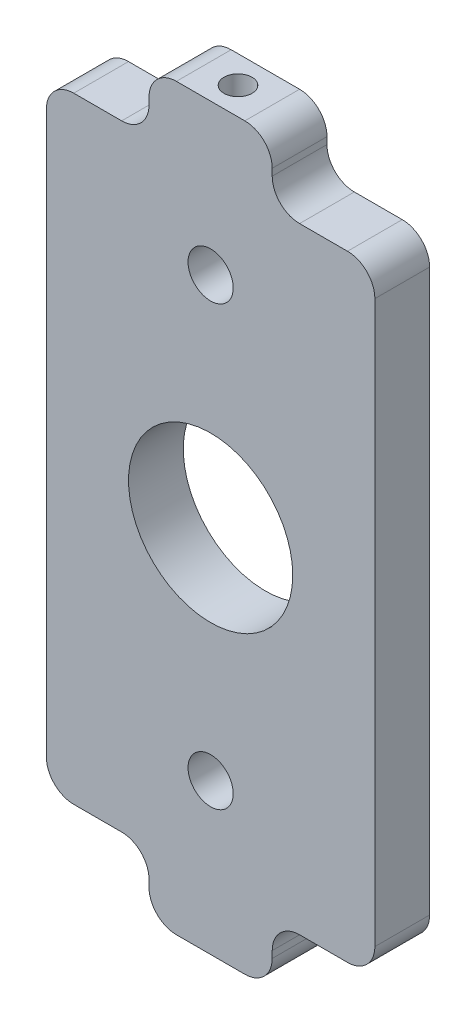
ISO-10303-21;
HEADER;
FILE_DESCRIPTION(('STEP AP214'),'2;1');
FILE_NAME('part.step','',(''),(''),'','','');
FILE_SCHEMA(('AUTOMOTIVE_DESIGN { 1 0 10303 214 1 1 1 1 }'));
ENDSEC;
DATA;
#1=APPLICATION_CONTEXT('core data for automotive mechanical design processes');
#2=APPLICATION_PROTOCOL_DEFINITION('international standard','automotive_design',2000,#1);
#3=PRODUCT_CONTEXT('',#1,'mechanical');
#4=PRODUCT('Part','Part','',(#3));
#5=PRODUCT_RELATED_PRODUCT_CATEGORY('part','',(#4));
#6=PRODUCT_DEFINITION_FORMATION('','',#4);
#7=PRODUCT_DEFINITION_CONTEXT('part definition',#1,'design');
#8=PRODUCT_DEFINITION('design','',#6,#7);
#9=PRODUCT_DEFINITION_SHAPE('','',#8);
#10=(LENGTH_UNIT() NAMED_UNIT(*) SI_UNIT(.MILLI.,.METRE.));
#11=(NAMED_UNIT(*) PLANE_ANGLE_UNIT() SI_UNIT($,.RADIAN.));
#12=(NAMED_UNIT(*) SI_UNIT($,.STERADIAN.) SOLID_ANGLE_UNIT());
#13=UNCERTAINTY_MEASURE_WITH_UNIT(LENGTH_MEASURE(1.E-05),#10,'distance_accuracy_value','');
#14=(GEOMETRIC_REPRESENTATION_CONTEXT(3) GLOBAL_UNCERTAINTY_ASSIGNED_CONTEXT((#13)) GLOBAL_UNIT_ASSIGNED_CONTEXT((#10,
#11,#12)) REPRESENTATION_CONTEXT('',''));
#15=CARTESIAN_POINT('',(0.,0.,0.));
#16=DIRECTION('',(0.,0.,1.));
#17=DIRECTION('',(1.,0.,0.));
#18=AXIS2_PLACEMENT_3D('',#15,#16,#17);
#19=CARTESIAN_POINT('',(-2.49999999999999,-25.,0.));
#20=DIRECTION('',(0.,0.,1.));
#21=DIRECTION('',(1.,0.,0.));
#22=AXIS2_PLACEMENT_3D('',#19,#20,#21);
#23=PLANE('',#22);
#24=CARTESIAN_POINT('',(0.,16.,0.));
#25=DIRECTION('',(0.,0.,-1.));
#26=DIRECTION('',(-1.,0.,0.));
#27=AXIS2_PLACEMENT_3D('',#24,#25,#26);
#28=CIRCLE('',#27,1.64999999999999);
#29=CARTESIAN_POINT('',(-1.64999999999999,16.,0.));
#30=VERTEX_POINT('',#29);
#31=EDGE_CURVE('E803',#30,#30,#28,.T.);
#32=ORIENTED_EDGE('',*,*,#31,.F.);
#33=EDGE_LOOP('',(#32));
#34=FACE_BOUND('',#33,.T.);
#35=CARTESIAN_POINT('',(-2.49999999999999,-25.,0.));
#36=DIRECTION('',(0.,0.,1.));
#37=DIRECTION('',(1.,0.,0.));
#38=AXIS2_PLACEMENT_3D('',#35,#36,#37);
#39=CIRCLE('',#38,2.);
#40=CARTESIAN_POINT('',(-4.49999999999999,-25.,0.));
#41=VERTEX_POINT('',#40);
#42=CARTESIAN_POINT('',(-2.49999999999999,-27.,0.));
#43=VERTEX_POINT('',#42);
#44=EDGE_CURVE('E230',#41,#43,#39,.T.);
#45=ORIENTED_EDGE('',*,*,#44,.F.);
#46=DIRECTION('',(0.,-1.,0.));
#47=VECTOR('',#46,1.);
#48=CARTESIAN_POINT('',(-4.49999999999999,-24.5,0.));
#49=LINE('',#48,#47);
#50=CARTESIAN_POINT('',(-4.49999999999999,-24.5,0.));
#51=VERTEX_POINT('',#50);
#52=EDGE_CURVE('E237',#51,#41,#49,.T.);
#53=ORIENTED_EDGE('',*,*,#52,.F.);
#54=CARTESIAN_POINT('',(-6.49999999999999,-24.5,0.));
#55=DIRECTION('',(0.,0.,-1.));
#56=DIRECTION('',(1.,0.,0.));
#57=AXIS2_PLACEMENT_3D('',#54,#55,#56);
#58=CIRCLE('',#57,2.);
#59=CARTESIAN_POINT('',(-6.49999999999999,-22.5,0.));
#60=VERTEX_POINT('',#59);
#61=EDGE_CURVE('E322',#60,#51,#58,.T.);
#62=ORIENTED_EDGE('',*,*,#61,.F.);
#63=DIRECTION('',(1.,0.,0.));
#64=VECTOR('',#63,1.);
#65=CARTESIAN_POINT('',(-10.,-22.5,0.));
#66=LINE('',#65,#64);
#67=CARTESIAN_POINT('',(-10.,-22.5,0.));
#68=VERTEX_POINT('',#67);
#69=EDGE_CURVE('E320',#68,#60,#66,.T.);
#70=ORIENTED_EDGE('',*,*,#69,.F.);
#71=CARTESIAN_POINT('',(-10.,-20.5,0.));
#72=DIRECTION('',(0.,0.,1.));
#73=DIRECTION('',(1.,0.,0.));
#74=AXIS2_PLACEMENT_3D('',#71,#72,#73);
#75=CIRCLE('',#74,2.);
#76=CARTESIAN_POINT('',(-12.,-20.5,0.));
#77=VERTEX_POINT('',#76);
#78=EDGE_CURVE('E318',#77,#68,#75,.T.);
#79=ORIENTED_EDGE('',*,*,#78,.F.);
#80=DIRECTION('',(0.,-1.,0.));
#81=VECTOR('',#80,1.);
#82=CARTESIAN_POINT('',(-12.,20.5,0.));
#83=LINE('',#82,#81);
#84=CARTESIAN_POINT('',(-12.,20.5,0.));
#85=VERTEX_POINT('',#84);
#86=EDGE_CURVE('E316',#85,#77,#83,.T.);
#87=ORIENTED_EDGE('',*,*,#86,.F.);
#88=CARTESIAN_POINT('',(-9.99999999999999,20.5,0.));
#89=DIRECTION('',(0.,0.,1.));
#90=DIRECTION('',(1.,0.,0.));
#91=AXIS2_PLACEMENT_3D('',#88,#89,#90);
#92=CIRCLE('',#91,2.);
#93=CARTESIAN_POINT('',(-9.99999999999999,22.5,0.));
#94=VERTEX_POINT('',#93);
#95=EDGE_CURVE('E314',#94,#85,#92,.T.);
#96=ORIENTED_EDGE('',*,*,#95,.F.);
#97=DIRECTION('',(-1.,0.,0.));
#98=VECTOR('',#97,1.);
#99=CARTESIAN_POINT('',(-4.49999999999999,22.5,0.));
#100=LINE('',#99,#98);
#101=CARTESIAN_POINT('',(-6.49999999999999,22.5,0.));
#102=VERTEX_POINT('',#101);
#103=EDGE_CURVE('E312',#102,#94,#100,.T.);
#104=ORIENTED_EDGE('',*,*,#103,.F.);
#105=CARTESIAN_POINT('',(-6.49999999999999,24.5,0.));
#106=DIRECTION('',(0.,0.,1.));
#107=DIRECTION('',(1.,0.,0.));
#108=AXIS2_PLACEMENT_3D('',#105,#106,#107);
#109=CIRCLE('',#108,2.);
#110=CARTESIAN_POINT('',(-4.49999999999999,24.5,0.));
#111=VERTEX_POINT('',#110);
#112=EDGE_CURVE('E46',#102,#111,#109,.T.);
#113=ORIENTED_EDGE('',*,*,#112,.T.);
#114=DIRECTION('',(0.,-1.,0.));
#115=VECTOR('',#114,1.);
#116=CARTESIAN_POINT('',(-4.49999999999999,25.,0.));
#117=LINE('',#116,#115);
#118=CARTESIAN_POINT('',(-4.49999999999999,25.,0.));
#119=VERTEX_POINT('',#118);
#120=EDGE_CURVE('E310',#119,#111,#117,.T.);
#121=ORIENTED_EDGE('',*,*,#120,.F.);
#122=CARTESIAN_POINT('',(-2.49999999999999,25.,0.));
#123=DIRECTION('',(0.,0.,1.));
#124=DIRECTION('',(1.,0.,0.));
#125=AXIS2_PLACEMENT_3D('',#122,#123,#124);
#126=CIRCLE('',#125,2.);
#127=CARTESIAN_POINT('',(-2.49999999999999,27.,0.));
#128=VERTEX_POINT('',#127);
#129=EDGE_CURVE('E308',#128,#119,#126,.T.);
#130=ORIENTED_EDGE('',*,*,#129,.F.);
#131=DIRECTION('',(-1.,0.,0.));
#132=VECTOR('',#131,1.);
#133=CARTESIAN_POINT('',(2.50000000000001,27.,0.));
#134=LINE('',#133,#132);
#135=CARTESIAN_POINT('',(2.50000000000001,27.,0.));
#136=VERTEX_POINT('',#135);
#137=EDGE_CURVE('E306',#136,#128,#134,.T.);
#138=ORIENTED_EDGE('',*,*,#137,.F.);
#139=CARTESIAN_POINT('',(2.50000000000001,25.,0.));
#140=DIRECTION('',(0.,0.,1.));
#141=DIRECTION('',(1.,0.,0.));
#142=AXIS2_PLACEMENT_3D('',#139,#140,#141);
#143=CIRCLE('',#142,2.);
#144=CARTESIAN_POINT('',(4.50000000000001,25.,0.));
#145=VERTEX_POINT('',#144);
#146=EDGE_CURVE('E304',#145,#136,#143,.T.);
#147=ORIENTED_EDGE('',*,*,#146,.F.);
#148=DIRECTION('',(0.,1.,0.));
#149=VECTOR('',#148,1.);
#150=CARTESIAN_POINT('',(4.50000000000001,22.5,0.));
#151=LINE('',#150,#149);
#152=CARTESIAN_POINT('',(4.50000000000001,24.5,0.));
#153=VERTEX_POINT('',#152);
#154=EDGE_CURVE('E302',#153,#145,#151,.T.);
#155=ORIENTED_EDGE('',*,*,#154,.F.);
#156=CARTESIAN_POINT('',(6.50000000000001,24.5,0.));
#157=DIRECTION('',(0.,0.,1.));
#158=DIRECTION('',(1.,0.,0.));
#159=AXIS2_PLACEMENT_3D('',#156,#157,#158);
#160=CIRCLE('',#159,2.);
#161=CARTESIAN_POINT('',(6.50000000000001,22.5,0.));
#162=VERTEX_POINT('',#161);
#163=EDGE_CURVE('E393',#153,#162,#160,.T.);
#164=ORIENTED_EDGE('',*,*,#163,.T.);
#165=DIRECTION('',(-1.,0.,0.));
#166=VECTOR('',#165,1.);
#167=CARTESIAN_POINT('',(10.,22.5,0.));
#168=LINE('',#167,#166);
#169=CARTESIAN_POINT('',(10.,22.5,0.));
#170=VERTEX_POINT('',#169);
#171=EDGE_CURVE('E299',#170,#162,#168,.T.);
#172=ORIENTED_EDGE('',*,*,#171,.F.);
#173=CARTESIAN_POINT('',(10.,20.5,0.));
#174=DIRECTION('',(0.,0.,1.));
#175=DIRECTION('',(1.,0.,0.));
#176=AXIS2_PLACEMENT_3D('',#173,#174,#175);
#177=CIRCLE('',#176,2.);
#178=CARTESIAN_POINT('',(12.,20.5,0.));
#179=VERTEX_POINT('',#178);
#180=EDGE_CURVE('E297',#179,#170,#177,.T.);
#181=ORIENTED_EDGE('',*,*,#180,.F.);
#182=DIRECTION('',(0.,1.,0.));
#183=VECTOR('',#182,1.);
#184=CARTESIAN_POINT('',(12.,-20.5,0.));
#185=LINE('',#184,#183);
#186=CARTESIAN_POINT('',(12.,-20.5,0.));
#187=VERTEX_POINT('',#186);
#188=EDGE_CURVE('E295',#187,#179,#185,.T.);
#189=ORIENTED_EDGE('',*,*,#188,.F.);
#190=CARTESIAN_POINT('',(10.,-20.5,0.));
#191=DIRECTION('',(0.,0.,1.));
#192=DIRECTION('',(1.,0.,0.));
#193=AXIS2_PLACEMENT_3D('',#190,#191,#192);
#194=CIRCLE('',#193,2.);
#195=CARTESIAN_POINT('',(10.,-22.5,0.));
#196=VERTEX_POINT('',#195);
#197=EDGE_CURVE('E293',#196,#187,#194,.T.);
#198=ORIENTED_EDGE('',*,*,#197,.F.);
#199=DIRECTION('',(1.,0.,0.));
#200=VECTOR('',#199,1.);
#201=CARTESIAN_POINT('',(6.50000000000001,-22.5,0.));
#202=LINE('',#201,#200);
#203=CARTESIAN_POINT('',(6.50000000000001,-22.5,0.));
#204=VERTEX_POINT('',#203);
#205=EDGE_CURVE('E291',#204,#196,#202,.T.);
#206=ORIENTED_EDGE('',*,*,#205,.F.);
#207=CARTESIAN_POINT('',(6.50000000000001,-24.5,0.));
#208=DIRECTION('',(0.,0.,-1.));
#209=DIRECTION('',(1.,0.,0.));
#210=AXIS2_PLACEMENT_3D('',#207,#208,#209);
#211=CIRCLE('',#210,2.);
#212=CARTESIAN_POINT('',(4.50000000000001,-24.5,0.));
#213=VERTEX_POINT('',#212);
#214=EDGE_CURVE('E289',#213,#204,#211,.T.);
#215=ORIENTED_EDGE('',*,*,#214,.F.);
#216=DIRECTION('',(0.,1.,0.));
#217=VECTOR('',#216,1.);
#218=CARTESIAN_POINT('',(4.50000000000001,-25.,0.));
#219=LINE('',#218,#217);
#220=CARTESIAN_POINT('',(4.50000000000001,-25.,0.));
#221=VERTEX_POINT('',#220);
#222=EDGE_CURVE('E287',#221,#213,#219,.T.);
#223=ORIENTED_EDGE('',*,*,#222,.F.);
#224=CARTESIAN_POINT('',(2.50000000000001,-25.,0.));
#225=DIRECTION('',(0.,0.,1.));
#226=DIRECTION('',(1.,0.,0.));
#227=AXIS2_PLACEMENT_3D('',#224,#225,#226);
#228=CIRCLE('',#227,2.);
#229=CARTESIAN_POINT('',(2.50000000000002,-27.,0.));
#230=VERTEX_POINT('',#229);
#231=EDGE_CURVE('E285',#230,#221,#228,.T.);
#232=ORIENTED_EDGE('',*,*,#231,.F.);
#233=DIRECTION('',(1.,0.,0.));
#234=VECTOR('',#233,1.);
#235=CARTESIAN_POINT('',(-2.49999999999999,-27.,0.));
#236=LINE('',#235,#234);
#237=EDGE_CURVE('E283',#43,#230,#236,.T.);
#238=ORIENTED_EDGE('',*,*,#237,.F.);
#239=EDGE_LOOP('',(#45,#53,#62,#70,#79,#87,#96,#104,#113,#121,#130,#138,#147,#155,#164,#172,
#181,#189,#198,#206,#215,#223,#232,#238));
#240=FACE_BOUND('',#239,.T.);
#241=CARTESIAN_POINT('',(0.,0.,0.));
#242=DIRECTION('',(0.,0.,1.));
#243=DIRECTION('',(1.,0.,0.));
#244=AXIS2_PLACEMENT_3D('',#241,#242,#243);
#245=CIRCLE('',#244,6.00000000000002);
#246=CARTESIAN_POINT('',(6.00000000000002,0.,0.));
#247=VERTEX_POINT('',#246);
#248=EDGE_CURVE('E226',#247,#247,#245,.T.);
#249=ORIENTED_EDGE('',*,*,#248,.T.);
#250=EDGE_LOOP('',(#249));
#251=FACE_BOUND('',#250,.T.);
#252=CARTESIAN_POINT('',(0.,-16.,0.));
#253=DIRECTION('',(0.,0.,-1.));
#254=DIRECTION('',(-1.,0.,0.));
#255=AXIS2_PLACEMENT_3D('',#252,#253,#254);
#256=CIRCLE('',#255,1.64999999999999);
#257=CARTESIAN_POINT('',(-1.64999999999999,-16.,0.));
#258=VERTEX_POINT('',#257);
#259=EDGE_CURVE('E805',#258,#258,#256,.T.);
#260=ORIENTED_EDGE('',*,*,#259,.F.);
#261=EDGE_LOOP('',(#260));
#262=FACE_BOUND('',#261,.T.);
#263=ADVANCED_FACE('F38',(#34,#240,#251,#262),#23,.F.);
#264=CARTESIAN_POINT('',(-2.49999999999999,-25.,4.));
#265=DIRECTION('',(0.,0.,1.));
#266=DIRECTION('',(1.,0.,0.));
#267=AXIS2_PLACEMENT_3D('',#264,#265,#266);
#268=PLANE('',#267);
#269=CARTESIAN_POINT('',(0.,16.,4.));
#270=DIRECTION('',(0.,0.,1.));
#271=DIRECTION('',(1.,0.,0.));
#272=AXIS2_PLACEMENT_3D('',#269,#270,#271);
#273=CIRCLE('',#272,1.64999999999999);
#274=CARTESIAN_POINT('',(1.64999999999999,16.,4.));
#275=VERTEX_POINT('',#274);
#276=EDGE_CURVE('E801',#275,#275,#273,.T.);
#277=ORIENTED_EDGE('',*,*,#276,.F.);
#278=EDGE_LOOP('',(#277));
#279=FACE_BOUND('',#278,.T.);
#280=CARTESIAN_POINT('',(0.,-16.,4.));
#281=DIRECTION('',(0.,0.,1.));
#282=DIRECTION('',(1.,0.,0.));
#283=AXIS2_PLACEMENT_3D('',#280,#281,#282);
#284=CIRCLE('',#283,1.64999999999999);
#285=CARTESIAN_POINT('',(1.64999999999999,-16.,4.));
#286=VERTEX_POINT('',#285);
#287=EDGE_CURVE('E220',#286,#286,#284,.T.);
#288=ORIENTED_EDGE('',*,*,#287,.F.);
#289=EDGE_LOOP('',(#288));
#290=FACE_BOUND('',#289,.T.);
#291=CARTESIAN_POINT('',(-2.49999999999999,-25.,4.));
#292=DIRECTION('',(0.,0.,1.));
#293=DIRECTION('',(1.,0.,0.));
#294=AXIS2_PLACEMENT_3D('',#291,#292,#293);
#295=CIRCLE('',#294,2.);
#296=CARTESIAN_POINT('',(-4.49999999999999,-25.,4.));
#297=VERTEX_POINT('',#296);
#298=CARTESIAN_POINT('',(-2.49999999999999,-27.,4.));
#299=VERTEX_POINT('',#298);
#300=EDGE_CURVE('E233',#297,#299,#295,.T.);
#301=ORIENTED_EDGE('',*,*,#300,.T.);
#302=DIRECTION('',(1.,0.,0.));
#303=VECTOR('',#302,1.);
#304=CARTESIAN_POINT('',(-2.49999999999999,-27.,4.));
#305=LINE('',#304,#303);
#306=CARTESIAN_POINT('',(2.50000000000002,-27.,4.));
#307=VERTEX_POINT('',#306);
#308=EDGE_CURVE('E236',#299,#307,#305,.T.);
#309=ORIENTED_EDGE('',*,*,#308,.T.);
#310=CARTESIAN_POINT('',(2.50000000000001,-25.,4.));
#311=DIRECTION('',(0.,0.,1.));
#312=DIRECTION('',(1.,0.,0.));
#313=AXIS2_PLACEMENT_3D('',#310,#311,#312);
#314=CIRCLE('',#313,2.);
#315=CARTESIAN_POINT('',(4.50000000000001,-25.,4.));
#316=VERTEX_POINT('',#315);
#317=EDGE_CURVE('E239',#307,#316,#314,.T.);
#318=ORIENTED_EDGE('',*,*,#317,.T.);
#319=DIRECTION('',(0.,1.,0.));
#320=VECTOR('',#319,1.);
#321=CARTESIAN_POINT('',(4.50000000000001,-25.,4.));
#322=LINE('',#321,#320);
#323=CARTESIAN_POINT('',(4.50000000000001,-24.5,4.));
#324=VERTEX_POINT('',#323);
#325=EDGE_CURVE('E241',#316,#324,#322,.T.);
#326=ORIENTED_EDGE('',*,*,#325,.T.);
#327=CARTESIAN_POINT('',(6.50000000000001,-24.5,4.));
#328=DIRECTION('',(0.,0.,-1.));
#329=DIRECTION('',(1.,0.,0.));
#330=AXIS2_PLACEMENT_3D('',#327,#328,#329);
#331=CIRCLE('',#330,2.);
#332=CARTESIAN_POINT('',(6.50000000000001,-22.5,4.));
#333=VERTEX_POINT('',#332);
#334=EDGE_CURVE('E243',#324,#333,#331,.T.);
#335=ORIENTED_EDGE('',*,*,#334,.T.);
#336=DIRECTION('',(1.,0.,0.));
#337=VECTOR('',#336,1.);
#338=CARTESIAN_POINT('',(6.50000000000001,-22.5,4.));
#339=LINE('',#338,#337);
#340=CARTESIAN_POINT('',(10.,-22.5,4.));
#341=VERTEX_POINT('',#340);
#342=EDGE_CURVE('E245',#333,#341,#339,.T.);
#343=ORIENTED_EDGE('',*,*,#342,.T.);
#344=CARTESIAN_POINT('',(10.,-20.5,4.));
#345=DIRECTION('',(0.,0.,1.));
#346=DIRECTION('',(1.,0.,0.));
#347=AXIS2_PLACEMENT_3D('',#344,#345,#346);
#348=CIRCLE('',#347,2.);
#349=CARTESIAN_POINT('',(12.,-20.5,4.));
#350=VERTEX_POINT('',#349);
#351=EDGE_CURVE('E247',#341,#350,#348,.T.);
#352=ORIENTED_EDGE('',*,*,#351,.T.);
#353=DIRECTION('',(0.,1.,0.));
#354=VECTOR('',#353,1.);
#355=CARTESIAN_POINT('',(12.,-20.5,4.));
#356=LINE('',#355,#354);
#357=CARTESIAN_POINT('',(12.,20.5,4.));
#358=VERTEX_POINT('',#357);
#359=EDGE_CURVE('E249',#350,#358,#356,.T.);
#360=ORIENTED_EDGE('',*,*,#359,.T.);
#361=CARTESIAN_POINT('',(10.,20.5,4.));
#362=DIRECTION('',(0.,0.,1.));
#363=DIRECTION('',(1.,0.,0.));
#364=AXIS2_PLACEMENT_3D('',#361,#362,#363);
#365=CIRCLE('',#364,2.);
#366=CARTESIAN_POINT('',(10.,22.5,4.));
#367=VERTEX_POINT('',#366);
#368=EDGE_CURVE('E251',#358,#367,#365,.T.);
#369=ORIENTED_EDGE('',*,*,#368,.T.);
#370=DIRECTION('',(-1.,0.,0.));
#371=VECTOR('',#370,1.);
#372=CARTESIAN_POINT('',(10.,22.5,4.));
#373=LINE('',#372,#371);
#374=CARTESIAN_POINT('',(6.50000000000001,22.5,4.));
#375=VERTEX_POINT('',#374);
#376=EDGE_CURVE('E253',#367,#375,#373,.T.);
#377=ORIENTED_EDGE('',*,*,#376,.T.);
#378=CARTESIAN_POINT('',(6.50000000000001,24.5,4.));
#379=DIRECTION('',(0.,0.,1.));
#380=DIRECTION('',(1.,0.,0.));
#381=AXIS2_PLACEMENT_3D('',#378,#379,#380);
#382=CIRCLE('',#381,2.);
#383=CARTESIAN_POINT('',(4.50000000000001,24.5,4.));
#384=VERTEX_POINT('',#383);
#385=EDGE_CURVE('E395',#375,#384,#382,.F.);
#386=ORIENTED_EDGE('',*,*,#385,.T.);
#387=DIRECTION('',(0.,1.,0.));
#388=VECTOR('',#387,1.);
#389=CARTESIAN_POINT('',(4.50000000000001,22.5,4.));
#390=LINE('',#389,#388);
#391=CARTESIAN_POINT('',(4.50000000000001,25.,4.));
#392=VERTEX_POINT('',#391);
#393=EDGE_CURVE('E256',#384,#392,#390,.T.);
#394=ORIENTED_EDGE('',*,*,#393,.T.);
#395=CARTESIAN_POINT('',(2.50000000000001,25.,4.));
#396=DIRECTION('',(0.,0.,1.));
#397=DIRECTION('',(1.,0.,0.));
#398=AXIS2_PLACEMENT_3D('',#395,#396,#397);
#399=CIRCLE('',#398,2.);
#400=CARTESIAN_POINT('',(2.50000000000001,27.,4.));
#401=VERTEX_POINT('',#400);
#402=EDGE_CURVE('E258',#392,#401,#399,.T.);
#403=ORIENTED_EDGE('',*,*,#402,.T.);
#404=DIRECTION('',(-1.,0.,0.));
#405=VECTOR('',#404,1.);
#406=CARTESIAN_POINT('',(2.50000000000001,27.,4.));
#407=LINE('',#406,#405);
#408=CARTESIAN_POINT('',(-2.49999999999999,27.,4.));
#409=VERTEX_POINT('',#408);
#410=EDGE_CURVE('E260',#401,#409,#407,.T.);
#411=ORIENTED_EDGE('',*,*,#410,.T.);
#412=CARTESIAN_POINT('',(-2.49999999999999,25.,4.));
#413=DIRECTION('',(0.,0.,1.));
#414=DIRECTION('',(1.,0.,0.));
#415=AXIS2_PLACEMENT_3D('',#412,#413,#414);
#416=CIRCLE('',#415,2.);
#417=CARTESIAN_POINT('',(-4.49999999999999,25.,4.));
#418=VERTEX_POINT('',#417);
#419=EDGE_CURVE('E262',#409,#418,#416,.T.);
#420=ORIENTED_EDGE('',*,*,#419,.T.);
#421=DIRECTION('',(0.,-1.,0.));
#422=VECTOR('',#421,1.);
#423=CARTESIAN_POINT('',(-4.49999999999999,25.,4.));
#424=LINE('',#423,#422);
#425=CARTESIAN_POINT('',(-4.49999999999999,24.5,4.));
#426=VERTEX_POINT('',#425);
#427=EDGE_CURVE('E264',#418,#426,#424,.T.);
#428=ORIENTED_EDGE('',*,*,#427,.T.);
#429=CARTESIAN_POINT('',(-6.49999999999999,24.5,4.));
#430=DIRECTION('',(0.,0.,1.));
#431=DIRECTION('',(1.,0.,0.));
#432=AXIS2_PLACEMENT_3D('',#429,#430,#431);
#433=CIRCLE('',#432,2.);
#434=CARTESIAN_POINT('',(-6.49999999999999,22.5,4.));
#435=VERTEX_POINT('',#434);
#436=EDGE_CURVE('E11',#426,#435,#433,.F.);
#437=ORIENTED_EDGE('',*,*,#436,.T.);
#438=DIRECTION('',(-1.,0.,0.));
#439=VECTOR('',#438,1.);
#440=CARTESIAN_POINT('',(-4.49999999999999,22.5,4.));
#441=LINE('',#440,#439);
#442=CARTESIAN_POINT('',(-9.99999999999999,22.5,4.));
#443=VERTEX_POINT('',#442);
#444=EDGE_CURVE('E266',#435,#443,#441,.T.);
#445=ORIENTED_EDGE('',*,*,#444,.T.);
#446=CARTESIAN_POINT('',(-9.99999999999999,20.5,4.));
#447=DIRECTION('',(0.,0.,1.));
#448=DIRECTION('',(1.,0.,0.));
#449=AXIS2_PLACEMENT_3D('',#446,#447,#448);
#450=CIRCLE('',#449,2.);
#451=CARTESIAN_POINT('',(-12.,20.5,4.));
#452=VERTEX_POINT('',#451);
#453=EDGE_CURVE('E268',#443,#452,#450,.T.);
#454=ORIENTED_EDGE('',*,*,#453,.T.);
#455=DIRECTION('',(0.,-1.,0.));
#456=VECTOR('',#455,1.);
#457=CARTESIAN_POINT('',(-12.,20.5,4.));
#458=LINE('',#457,#456);
#459=CARTESIAN_POINT('',(-12.,-20.5,4.));
#460=VERTEX_POINT('',#459);
#461=EDGE_CURVE('E270',#452,#460,#458,.T.);
#462=ORIENTED_EDGE('',*,*,#461,.T.);
#463=CARTESIAN_POINT('',(-10.,-20.5,4.));
#464=DIRECTION('',(0.,0.,1.));
#465=DIRECTION('',(1.,0.,0.));
#466=AXIS2_PLACEMENT_3D('',#463,#464,#465);
#467=CIRCLE('',#466,2.);
#468=CARTESIAN_POINT('',(-10.,-22.5,4.));
#469=VERTEX_POINT('',#468);
#470=EDGE_CURVE('E272',#460,#469,#467,.T.);
#471=ORIENTED_EDGE('',*,*,#470,.T.);
#472=DIRECTION('',(1.,0.,0.));
#473=VECTOR('',#472,1.);
#474=CARTESIAN_POINT('',(-10.,-22.5,4.));
#475=LINE('',#474,#473);
#476=CARTESIAN_POINT('',(-6.49999999999999,-22.5,4.));
#477=VERTEX_POINT('',#476);
#478=EDGE_CURVE('E274',#469,#477,#475,.T.);
#479=ORIENTED_EDGE('',*,*,#478,.T.);
#480=CARTESIAN_POINT('',(-6.49999999999999,-24.5,4.));
#481=DIRECTION('',(0.,0.,-1.));
#482=DIRECTION('',(1.,0.,0.));
#483=AXIS2_PLACEMENT_3D('',#480,#481,#482);
#484=CIRCLE('',#483,2.);
#485=CARTESIAN_POINT('',(-4.49999999999999,-24.5,4.));
#486=VERTEX_POINT('',#485);
#487=EDGE_CURVE('E276',#477,#486,#484,.T.);
#488=ORIENTED_EDGE('',*,*,#487,.T.);
#489=DIRECTION('',(0.,-1.,0.));
#490=VECTOR('',#489,1.);
#491=CARTESIAN_POINT('',(-4.49999999999999,-24.5,4.));
#492=LINE('',#491,#490);
#493=EDGE_CURVE('E278',#486,#297,#492,.T.);
#494=ORIENTED_EDGE('',*,*,#493,.T.);
#495=EDGE_LOOP('',(#301,#309,#318,#326,#335,#343,#352,#360,#369,#377,#386,#394,#403,#411,#420,
#428,#437,#445,#454,#462,#471,#479,#488,#494));
#496=FACE_BOUND('',#495,.T.);
#497=CARTESIAN_POINT('',(0.,0.,4.));
#498=DIRECTION('',(0.,0.,1.));
#499=DIRECTION('',(1.,0.,0.));
#500=AXIS2_PLACEMENT_3D('',#497,#498,#499);
#501=CIRCLE('',#500,6.00000000000002);
#502=CARTESIAN_POINT('',(6.00000000000002,0.,4.));
#503=VERTEX_POINT('',#502);
#504=EDGE_CURVE('E227',#503,#503,#501,.T.);
#505=ORIENTED_EDGE('',*,*,#504,.F.);
#506=EDGE_LOOP('',(#505));
#507=FACE_BOUND('',#506,.T.);
#508=ADVANCED_FACE('F399',(#279,#290,#496,#507),#268,.T.);
#509=CARTESIAN_POINT('',(-2.49999999999999,-25.,4.));
#510=DIRECTION('',(0.,0.,-1.));
#511=DIRECTION('',(-1.,0.,0.));
#512=AXIS2_PLACEMENT_3D('',#509,#510,#511);
#513=CYLINDRICAL_SURFACE('',#512,2.);
#514=ORIENTED_EDGE('',*,*,#44,.T.);
#515=DIRECTION('',(0.,0.,-1.));
#516=VECTOR('',#515,1.);
#517=CARTESIAN_POINT('',(-2.49999999999999,-27.,4.));
#518=LINE('',#517,#516);
#519=EDGE_CURVE('E381',#299,#43,#518,.T.);
#520=ORIENTED_EDGE('',*,*,#519,.F.);
#521=ORIENTED_EDGE('',*,*,#300,.F.);
#522=DIRECTION('',(0.,0.,-1.));
#523=VECTOR('',#522,1.);
#524=CARTESIAN_POINT('',(-4.49999999999999,-25.,4.));
#525=LINE('',#524,#523);
#526=EDGE_CURVE('E280',#297,#41,#525,.T.);
#527=ORIENTED_EDGE('',*,*,#526,.T.);
#528=EDGE_LOOP('',(#514,#520,#521,#527));
#529=FACE_BOUND('',#528,.T.);
#530=ADVANCED_FACE('F459',(#529),#513,.T.);
#531=CARTESIAN_POINT('',(-2.49999999999999,-27.,4.));
#532=DIRECTION('',(0.,1.,0.));
#533=DIRECTION('',(-1.,0.,0.));
#534=AXIS2_PLACEMENT_3D('',#531,#532,#533);
#535=PLANE('',#534);
#536=CARTESIAN_POINT('',(0.,-27.,2.));
#537=DIRECTION('',(0.,-1.,0.));
#538=DIRECTION('',(0.,0.,-1.));
#539=AXIS2_PLACEMENT_3D('',#536,#537,#538);
#540=CIRCLE('',#539,1.025);
#541=CARTESIAN_POINT('',(0.,-27.,0.975000000000001));
#542=VERTEX_POINT('',#541);
#543=EDGE_CURVE('E214',#542,#542,#540,.T.);
#544=ORIENTED_EDGE('',*,*,#543,.F.);
#545=EDGE_LOOP('',(#544));
#546=FACE_BOUND('',#545,.T.);
#547=ORIENTED_EDGE('',*,*,#237,.T.);
#548=DIRECTION('',(0.,0.,-1.));
#549=VECTOR('',#548,1.);
#550=CARTESIAN_POINT('',(2.50000000000002,-27.,4.));
#551=LINE('',#550,#549);
#552=EDGE_CURVE('E378',#307,#230,#551,.T.);
#553=ORIENTED_EDGE('',*,*,#552,.F.);
#554=ORIENTED_EDGE('',*,*,#308,.F.);
#555=ORIENTED_EDGE('',*,*,#519,.T.);
#556=EDGE_LOOP('',(#547,#553,#554,#555));
#557=FACE_BOUND('',#556,.T.);
#558=ADVANCED_FACE('F456',(#546,#557),#535,.F.);
#559=CARTESIAN_POINT('',(2.50000000000001,-25.,4.));
#560=DIRECTION('',(0.,0.,-1.));
#561=DIRECTION('',(-1.,0.,0.));
#562=AXIS2_PLACEMENT_3D('',#559,#560,#561);
#563=CYLINDRICAL_SURFACE('',#562,2.);
#564=ORIENTED_EDGE('',*,*,#231,.T.);
#565=DIRECTION('',(0.,0.,-1.));
#566=VECTOR('',#565,1.);
#567=CARTESIAN_POINT('',(4.50000000000001,-25.,4.));
#568=LINE('',#567,#566);
#569=EDGE_CURVE('E375',#316,#221,#568,.T.);
#570=ORIENTED_EDGE('',*,*,#569,.F.);
#571=ORIENTED_EDGE('',*,*,#317,.F.);
#572=ORIENTED_EDGE('',*,*,#552,.T.);
#573=EDGE_LOOP('',(#564,#570,#571,#572));
#574=FACE_BOUND('',#573,.T.);
#575=ADVANCED_FACE('F451',(#574),#563,.T.);
#576=CARTESIAN_POINT('',(4.50000000000001,-25.,4.));
#577=DIRECTION('',(-1.,0.,0.));
#578=DIRECTION('',(0.,0.,1.));
#579=AXIS2_PLACEMENT_3D('',#576,#577,#578);
#580=PLANE('',#579);
#581=ORIENTED_EDGE('',*,*,#222,.T.);
#582=DIRECTION('',(0.,0.,-1.));
#583=VECTOR('',#582,1.);
#584=CARTESIAN_POINT('',(4.50000000000001,-24.5,4.));
#585=LINE('',#584,#583);
#586=EDGE_CURVE('E372',#324,#213,#585,.T.);
#587=ORIENTED_EDGE('',*,*,#586,.F.);
#588=ORIENTED_EDGE('',*,*,#325,.F.);
#589=ORIENTED_EDGE('',*,*,#569,.T.);
#590=EDGE_LOOP('',(#581,#587,#588,#589));
#591=FACE_BOUND('',#590,.T.);
#592=ADVANCED_FACE('F447',(#591),#580,.F.);
#593=CARTESIAN_POINT('',(6.50000000000001,-24.5,4.));
#594=DIRECTION('',(0.,0.,-1.));
#595=DIRECTION('',(-1.,0.,0.));
#596=AXIS2_PLACEMENT_3D('',#593,#594,#595);
#597=CYLINDRICAL_SURFACE('',#596,2.);
#598=ORIENTED_EDGE('',*,*,#214,.T.);
#599=DIRECTION('',(0.,0.,-1.));
#600=VECTOR('',#599,1.);
#601=CARTESIAN_POINT('',(6.50000000000001,-22.5,4.));
#602=LINE('',#601,#600);
#603=EDGE_CURVE('E369',#333,#204,#602,.T.);
#604=ORIENTED_EDGE('',*,*,#603,.F.);
#605=ORIENTED_EDGE('',*,*,#334,.F.);
#606=ORIENTED_EDGE('',*,*,#586,.T.);
#607=EDGE_LOOP('',(#598,#604,#605,#606));
#608=FACE_BOUND('',#607,.T.);
#609=ADVANCED_FACE('F442',(#608),#597,.F.);
#610=CARTESIAN_POINT('',(6.50000000000001,-22.5,4.));
#611=DIRECTION('',(0.,1.,0.));
#612=DIRECTION('',(0.,0.,1.));
#613=AXIS2_PLACEMENT_3D('',#610,#611,#612);
#614=PLANE('',#613);
#615=ORIENTED_EDGE('',*,*,#205,.T.);
#616=DIRECTION('',(0.,0.,-1.));
#617=VECTOR('',#616,1.);
#618=CARTESIAN_POINT('',(10.,-22.5,4.));
#619=LINE('',#618,#617);
#620=EDGE_CURVE('E366',#341,#196,#619,.T.);
#621=ORIENTED_EDGE('',*,*,#620,.F.);
#622=ORIENTED_EDGE('',*,*,#342,.F.);
#623=ORIENTED_EDGE('',*,*,#603,.T.);
#624=EDGE_LOOP('',(#615,#621,#622,#623));
#625=FACE_BOUND('',#624,.T.);
#626=ADVANCED_FACE('F436',(#625),#614,.F.);
#627=CARTESIAN_POINT('',(10.,-20.5,4.));
#628=DIRECTION('',(0.,0.,-1.));
#629=DIRECTION('',(-1.,0.,0.));
#630=AXIS2_PLACEMENT_3D('',#627,#628,#629);
#631=CYLINDRICAL_SURFACE('',#630,2.);
#632=ORIENTED_EDGE('',*,*,#197,.T.);
#633=DIRECTION('',(0.,0.,-1.));
#634=VECTOR('',#633,1.);
#635=CARTESIAN_POINT('',(12.,-20.5,4.));
#636=LINE('',#635,#634);
#637=EDGE_CURVE('E363',#350,#187,#636,.T.);
#638=ORIENTED_EDGE('',*,*,#637,.F.);
#639=ORIENTED_EDGE('',*,*,#351,.F.);
#640=ORIENTED_EDGE('',*,*,#620,.T.);
#641=EDGE_LOOP('',(#632,#638,#639,#640));
#642=FACE_BOUND('',#641,.T.);
#643=ADVANCED_FACE('F432',(#642),#631,.T.);
#644=CARTESIAN_POINT('',(12.,-20.5,4.));
#645=DIRECTION('',(-1.,0.,0.));
#646=DIRECTION('',(0.,-1.,0.));
#647=AXIS2_PLACEMENT_3D('',#644,#645,#646);
#648=PLANE('',#647);
#649=ORIENTED_EDGE('',*,*,#188,.T.);
#650=DIRECTION('',(0.,0.,-1.));
#651=VECTOR('',#650,1.);
#652=CARTESIAN_POINT('',(12.,20.5,4.));
#653=LINE('',#652,#651);
#654=EDGE_CURVE('E360',#358,#179,#653,.T.);
#655=ORIENTED_EDGE('',*,*,#654,.F.);
#656=ORIENTED_EDGE('',*,*,#359,.F.);
#657=ORIENTED_EDGE('',*,*,#637,.T.);
#658=EDGE_LOOP('',(#649,#655,#656,#657));
#659=FACE_BOUND('',#658,.T.);
#660=ADVANCED_FACE('F427',(#659),#648,.F.);
#661=CARTESIAN_POINT('',(10.,20.5,4.));
#662=DIRECTION('',(0.,0.,-1.));
#663=DIRECTION('',(-1.,0.,0.));
#664=AXIS2_PLACEMENT_3D('',#661,#662,#663);
#665=CYLINDRICAL_SURFACE('',#664,2.);
#666=ORIENTED_EDGE('',*,*,#180,.T.);
#667=DIRECTION('',(0.,0.,-1.));
#668=VECTOR('',#667,1.);
#669=CARTESIAN_POINT('',(10.,22.5,4.));
#670=LINE('',#669,#668);
#671=EDGE_CURVE('E357',#367,#170,#670,.T.);
#672=ORIENTED_EDGE('',*,*,#671,.F.);
#673=ORIENTED_EDGE('',*,*,#368,.F.);
#674=ORIENTED_EDGE('',*,*,#654,.T.);
#675=EDGE_LOOP('',(#666,#672,#673,#674));
#676=FACE_BOUND('',#675,.T.);
#677=ADVANCED_FACE('F421',(#676),#665,.T.);
#678=CARTESIAN_POINT('',(10.,22.5,4.));
#679=DIRECTION('',(0.,-1.,0.));
#680=DIRECTION('',(0.,0.,-1.));
#681=AXIS2_PLACEMENT_3D('',#678,#679,#680);
#682=PLANE('',#681);
#683=ORIENTED_EDGE('',*,*,#171,.T.);
#684=DIRECTION('',(0.,0.,-1.));
#685=VECTOR('',#684,1.);
#686=CARTESIAN_POINT('',(6.50000000000001,22.5,4.));
#687=LINE('',#686,#685);
#688=EDGE_CURVE('E387',#162,#375,#687,.F.);
#689=ORIENTED_EDGE('',*,*,#688,.T.);
#690=ORIENTED_EDGE('',*,*,#376,.F.);
#691=ORIENTED_EDGE('',*,*,#671,.T.);
#692=EDGE_LOOP('',(#683,#689,#690,#691));
#693=FACE_BOUND('',#692,.T.);
#694=ADVANCED_FACE('F417',(#693),#682,.F.);
#695=CARTESIAN_POINT('',(4.50000000000001,22.5,4.));
#696=DIRECTION('',(-1.,0.,0.));
#697=DIRECTION('',(0.,0.,1.));
#698=AXIS2_PLACEMENT_3D('',#695,#696,#697);
#699=PLANE('',#698);
#700=ORIENTED_EDGE('',*,*,#393,.F.);
#701=DIRECTION('',(0.,0.,-1.));
#702=VECTOR('',#701,1.);
#703=CARTESIAN_POINT('',(4.50000000000001,24.5,0.));
#704=LINE('',#703,#702);
#705=EDGE_CURVE('E384',#384,#153,#704,.T.);
#706=ORIENTED_EDGE('',*,*,#705,.T.);
#707=ORIENTED_EDGE('',*,*,#154,.T.);
#708=DIRECTION('',(0.,0.,-1.));
#709=VECTOR('',#708,1.);
#710=CARTESIAN_POINT('',(4.50000000000001,25.,4.));
#711=LINE('',#710,#709);
#712=EDGE_CURVE('E354',#392,#145,#711,.T.);
#713=ORIENTED_EDGE('',*,*,#712,.F.);
#714=EDGE_LOOP('',(#700,#706,#707,#713));
#715=FACE_BOUND('',#714,.T.);
#716=ADVANCED_FACE('F407',(#715),#699,.F.);
#717=CARTESIAN_POINT('',(2.50000000000001,25.,4.));
#718=DIRECTION('',(0.,0.,-1.));
#719=DIRECTION('',(-1.,0.,0.));
#720=AXIS2_PLACEMENT_3D('',#717,#718,#719);
#721=CYLINDRICAL_SURFACE('',#720,2.);
#722=ORIENTED_EDGE('',*,*,#146,.T.);
#723=DIRECTION('',(0.,0.,-1.));
#724=VECTOR('',#723,1.);
#725=CARTESIAN_POINT('',(2.50000000000001,27.,4.));
#726=LINE('',#725,#724);
#727=EDGE_CURVE('E351',#401,#136,#726,.T.);
#728=ORIENTED_EDGE('',*,*,#727,.F.);
#729=ORIENTED_EDGE('',*,*,#402,.F.);
#730=ORIENTED_EDGE('',*,*,#712,.T.);
#731=EDGE_LOOP('',(#722,#728,#729,#730));
#732=FACE_BOUND('',#731,.T.);
#733=ADVANCED_FACE('F509',(#732),#721,.T.);
#734=CARTESIAN_POINT('',(2.50000000000001,27.,4.));
#735=DIRECTION('',(0.,-1.,0.));
#736=DIRECTION('',(0.,0.,-1.));
#737=AXIS2_PLACEMENT_3D('',#734,#735,#736);
#738=PLANE('',#737);
#739=CARTESIAN_POINT('',(0.,27.,2.));
#740=DIRECTION('',(0.,1.,0.));
#741=DIRECTION('',(0.,0.,1.));
#742=AXIS2_PLACEMENT_3D('',#739,#740,#741);
#743=CIRCLE('',#742,1.025);
#744=CARTESIAN_POINT('',(0.,27.,3.025));
#745=VERTEX_POINT('',#744);
#746=EDGE_CURVE('E213',#745,#745,#743,.T.);
#747=ORIENTED_EDGE('',*,*,#746,.F.);
#748=EDGE_LOOP('',(#747));
#749=FACE_BOUND('',#748,.T.);
#750=ORIENTED_EDGE('',*,*,#137,.T.);
#751=DIRECTION('',(0.,0.,-1.));
#752=VECTOR('',#751,1.);
#753=CARTESIAN_POINT('',(-2.49999999999999,27.,4.));
#754=LINE('',#753,#752);
#755=EDGE_CURVE('E348',#409,#128,#754,.T.);
#756=ORIENTED_EDGE('',*,*,#755,.F.);
#757=ORIENTED_EDGE('',*,*,#410,.F.);
#758=ORIENTED_EDGE('',*,*,#727,.T.);
#759=EDGE_LOOP('',(#750,#756,#757,#758));
#760=FACE_BOUND('',#759,.T.);
#761=ADVANCED_FACE('F506',(#749,#760),#738,.F.);
#762=CARTESIAN_POINT('',(-2.49999999999999,25.,4.));
#763=DIRECTION('',(0.,0.,-1.));
#764=DIRECTION('',(-1.,0.,0.));
#765=AXIS2_PLACEMENT_3D('',#762,#763,#764);
#766=CYLINDRICAL_SURFACE('',#765,2.);
#767=ORIENTED_EDGE('',*,*,#129,.T.);
#768=DIRECTION('',(0.,0.,-1.));
#769=VECTOR('',#768,1.);
#770=CARTESIAN_POINT('',(-4.49999999999999,25.,4.));
#771=LINE('',#770,#769);
#772=EDGE_CURVE('E345',#418,#119,#771,.T.);
#773=ORIENTED_EDGE('',*,*,#772,.F.);
#774=ORIENTED_EDGE('',*,*,#419,.F.);
#775=ORIENTED_EDGE('',*,*,#755,.T.);
#776=EDGE_LOOP('',(#767,#773,#774,#775));
#777=FACE_BOUND('',#776,.T.);
#778=ADVANCED_FACE('F502',(#777),#766,.T.);
#779=CARTESIAN_POINT('',(-4.49999999999999,25.,4.));
#780=DIRECTION('',(1.,0.,0.));
#781=DIRECTION('',(0.,1.,0.));
#782=AXIS2_PLACEMENT_3D('',#779,#780,#781);
#783=PLANE('',#782);
#784=ORIENTED_EDGE('',*,*,#120,.T.);
#785=DIRECTION('',(0.,0.,-1.));
#786=VECTOR('',#785,1.);
#787=CARTESIAN_POINT('',(-4.49999999999999,24.5,4.));
#788=LINE('',#787,#786);
#789=EDGE_CURVE('E53',#111,#426,#788,.F.);
#790=ORIENTED_EDGE('',*,*,#789,.T.);
#791=ORIENTED_EDGE('',*,*,#427,.F.);
#792=ORIENTED_EDGE('',*,*,#772,.T.);
#793=EDGE_LOOP('',(#784,#790,#791,#792));
#794=FACE_BOUND('',#793,.T.);
#795=ADVANCED_FACE('F498',(#794),#783,.F.);
#796=CARTESIAN_POINT('',(-4.49999999999999,22.5,4.));
#797=DIRECTION('',(0.,-1.,0.));
#798=DIRECTION('',(0.,0.,-1.));
#799=AXIS2_PLACEMENT_3D('',#796,#797,#798);
#800=PLANE('',#799);
#801=ORIENTED_EDGE('',*,*,#444,.F.);
#802=DIRECTION('',(0.,0.,-1.));
#803=VECTOR('',#802,1.);
#804=CARTESIAN_POINT('',(-6.49999999999999,22.5,0.));
#805=LINE('',#804,#803);
#806=EDGE_CURVE('E389',#435,#102,#805,.T.);
#807=ORIENTED_EDGE('',*,*,#806,.T.);
#808=ORIENTED_EDGE('',*,*,#103,.T.);
#809=DIRECTION('',(0.,0.,-1.));
#810=VECTOR('',#809,1.);
#811=CARTESIAN_POINT('',(-9.99999999999999,22.5,4.));
#812=LINE('',#811,#810);
#813=EDGE_CURVE('E342',#443,#94,#812,.T.);
#814=ORIENTED_EDGE('',*,*,#813,.F.);
#815=EDGE_LOOP('',(#801,#807,#808,#814));
#816=FACE_BOUND('',#815,.T.);
#817=ADVANCED_FACE('F492',(#816),#800,.F.);
#818=CARTESIAN_POINT('',(-9.99999999999999,20.5,4.));
#819=DIRECTION('',(0.,0.,-1.));
#820=DIRECTION('',(-1.,0.,0.));
#821=AXIS2_PLACEMENT_3D('',#818,#819,#820);
#822=CYLINDRICAL_SURFACE('',#821,2.);
#823=ORIENTED_EDGE('',*,*,#95,.T.);
#824=DIRECTION('',(0.,0.,-1.));
#825=VECTOR('',#824,1.);
#826=CARTESIAN_POINT('',(-12.,20.5,4.));
#827=LINE('',#826,#825);
#828=EDGE_CURVE('E339',#452,#85,#827,.T.);
#829=ORIENTED_EDGE('',*,*,#828,.F.);
#830=ORIENTED_EDGE('',*,*,#453,.F.);
#831=ORIENTED_EDGE('',*,*,#813,.T.);
#832=EDGE_LOOP('',(#823,#829,#830,#831));
#833=FACE_BOUND('',#832,.T.);
#834=ADVANCED_FACE('F488',(#833),#822,.T.);
#835=CARTESIAN_POINT('',(-12.,20.5,4.));
#836=DIRECTION('',(1.,0.,0.));
#837=DIRECTION('',(0.,1.,0.));
#838=AXIS2_PLACEMENT_3D('',#835,#836,#837);
#839=PLANE('',#838);
#840=ORIENTED_EDGE('',*,*,#86,.T.);
#841=DIRECTION('',(0.,0.,-1.));
#842=VECTOR('',#841,1.);
#843=CARTESIAN_POINT('',(-12.,-20.5,4.));
#844=LINE('',#843,#842);
#845=EDGE_CURVE('E336',#460,#77,#844,.T.);
#846=ORIENTED_EDGE('',*,*,#845,.F.);
#847=ORIENTED_EDGE('',*,*,#461,.F.);
#848=ORIENTED_EDGE('',*,*,#828,.T.);
#849=EDGE_LOOP('',(#840,#846,#847,#848));
#850=FACE_BOUND('',#849,.T.);
#851=ADVANCED_FACE('F483',(#850),#839,.F.);
#852=CARTESIAN_POINT('',(-10.,-20.5,4.));
#853=DIRECTION('',(0.,0.,-1.));
#854=DIRECTION('',(-1.,0.,0.));
#855=AXIS2_PLACEMENT_3D('',#852,#853,#854);
#856=CYLINDRICAL_SURFACE('',#855,2.);
#857=ORIENTED_EDGE('',*,*,#78,.T.);
#858=DIRECTION('',(0.,0.,-1.));
#859=VECTOR('',#858,1.);
#860=CARTESIAN_POINT('',(-10.,-22.5,4.));
#861=LINE('',#860,#859);
#862=EDGE_CURVE('E333',#469,#68,#861,.T.);
#863=ORIENTED_EDGE('',*,*,#862,.F.);
#864=ORIENTED_EDGE('',*,*,#470,.F.);
#865=ORIENTED_EDGE('',*,*,#845,.T.);
#866=EDGE_LOOP('',(#857,#863,#864,#865));
#867=FACE_BOUND('',#866,.T.);
#868=ADVANCED_FACE('F478',(#867),#856,.T.);
#869=CARTESIAN_POINT('',(-10.,-22.5,4.));
#870=DIRECTION('',(0.,1.,0.));
#871=DIRECTION('',(0.,0.,1.));
#872=AXIS2_PLACEMENT_3D('',#869,#870,#871);
#873=PLANE('',#872);
#874=ORIENTED_EDGE('',*,*,#69,.T.);
#875=DIRECTION('',(0.,0.,-1.));
#876=VECTOR('',#875,1.);
#877=CARTESIAN_POINT('',(-6.49999999999999,-22.5,4.));
#878=LINE('',#877,#876);
#879=EDGE_CURVE('E330',#477,#60,#878,.T.);
#880=ORIENTED_EDGE('',*,*,#879,.F.);
#881=ORIENTED_EDGE('',*,*,#478,.F.);
#882=ORIENTED_EDGE('',*,*,#862,.T.);
#883=EDGE_LOOP('',(#874,#880,#881,#882));
#884=FACE_BOUND('',#883,.T.);
#885=ADVANCED_FACE('F474',(#884),#873,.F.);
#886=CARTESIAN_POINT('',(-6.49999999999999,-24.5,4.));
#887=DIRECTION('',(0.,0.,-1.));
#888=DIRECTION('',(-1.,0.,0.));
#889=AXIS2_PLACEMENT_3D('',#886,#887,#888);
#890=CYLINDRICAL_SURFACE('',#889,2.);
#891=ORIENTED_EDGE('',*,*,#61,.T.);
#892=DIRECTION('',(0.,0.,-1.));
#893=VECTOR('',#892,1.);
#894=CARTESIAN_POINT('',(-4.49999999999999,-24.5,4.));
#895=LINE('',#894,#893);
#896=EDGE_CURVE('E327',#486,#51,#895,.T.);
#897=ORIENTED_EDGE('',*,*,#896,.F.);
#898=ORIENTED_EDGE('',*,*,#487,.F.);
#899=ORIENTED_EDGE('',*,*,#879,.T.);
#900=EDGE_LOOP('',(#891,#897,#898,#899));
#901=FACE_BOUND('',#900,.T.);
#902=ADVANCED_FACE('F469',(#901),#890,.F.);
#903=CARTESIAN_POINT('',(-4.49999999999999,-24.5,4.));
#904=DIRECTION('',(1.,0.,0.));
#905=DIRECTION('',(0.,1.,0.));
#906=AXIS2_PLACEMENT_3D('',#903,#904,#905);
#907=PLANE('',#906);
#908=ORIENTED_EDGE('',*,*,#52,.T.);
#909=ORIENTED_EDGE('',*,*,#526,.F.);
#910=ORIENTED_EDGE('',*,*,#493,.F.);
#911=ORIENTED_EDGE('',*,*,#896,.T.);
#912=EDGE_LOOP('',(#908,#909,#910,#911));
#913=FACE_BOUND('',#912,.T.);
#914=ADVANCED_FACE('F463',(#913),#907,.F.);
#915=CARTESIAN_POINT('',(0.,0.,4.));
#916=DIRECTION('',(0.,0.,-1.));
#917=DIRECTION('',(-1.,0.,0.));
#918=AXIS2_PLACEMENT_3D('',#915,#916,#917);
#919=CYLINDRICAL_SURFACE('',#918,6.00000000000002);
#920=ORIENTED_EDGE('',*,*,#504,.T.);
#921=EDGE_LOOP('',(#920));
#922=FACE_BOUND('',#921,.T.);
#923=ORIENTED_EDGE('',*,*,#248,.F.);
#924=EDGE_LOOP('',(#923));
#925=FACE_BOUND('',#924,.T.);
#926=ADVANCED_FACE('F534',(#922,#925),#919,.F.);
#927=CARTESIAN_POINT('',(0.,19.75,2.));
#928=DIRECTION('',(0.,1.,0.));
#929=DIRECTION('',(0.,0.,1.));
#930=AXIS2_PLACEMENT_3D('',#927,#928,#929);
#931=CONICAL_SURFACE('',#930,1.025,1.02974425867665);
#932=CARTESIAN_POINT('',(0.,19.1341178654967,2.));
#933=VERTEX_POINT('',#932);
#934=VERTEX_LOOP('',#933);
#935=FACE_BOUND('',#934,.T.);
#936=CARTESIAN_POINT('',(0.,19.75,2.));
#937=DIRECTION('',(0.,1.,0.));
#938=DIRECTION('',(0.,0.,1.));
#939=AXIS2_PLACEMENT_3D('',#936,#937,#938);
#940=CIRCLE('',#939,1.025);
#941=CARTESIAN_POINT('',(0.,19.75,3.025));
#942=VERTEX_POINT('',#941);
#943=EDGE_CURVE('E217',#942,#942,#940,.T.);
#944=ORIENTED_EDGE('',*,*,#943,.T.);
#945=EDGE_LOOP('',(#944));
#946=FACE_BOUND('',#945,.T.);
#947=ADVANCED_FACE('F597',(#935,#946),#931,.F.);
#948=CARTESIAN_POINT('',(0.,27.,2.));
#949=DIRECTION('',(0.,1.,0.));
#950=DIRECTION('',(0.,0.,1.));
#951=AXIS2_PLACEMENT_3D('',#948,#949,#950);
#952=CYLINDRICAL_SURFACE('',#951,1.025);
#953=ORIENTED_EDGE('',*,*,#943,.F.);
#954=EDGE_LOOP('',(#953));
#955=FACE_BOUND('',#954,.T.);
#956=ORIENTED_EDGE('',*,*,#746,.T.);
#957=EDGE_LOOP('',(#956));
#958=FACE_BOUND('',#957,.T.);
#959=ADVANCED_FACE('F207',(#955,#958),#952,.F.);
#960=CARTESIAN_POINT('',(0.,-19.75,2.));
#961=DIRECTION('',(0.,-1.,0.));
#962=DIRECTION('',(0.,0.,-1.));
#963=AXIS2_PLACEMENT_3D('',#960,#961,#962);
#964=CONICAL_SURFACE('',#963,1.025,1.02974425867665);
#965=CARTESIAN_POINT('',(0.,-19.1341178654967,2.));
#966=VERTEX_POINT('',#965);
#967=VERTEX_LOOP('',#966);
#968=FACE_BOUND('',#967,.T.);
#969=CARTESIAN_POINT('',(0.,-19.75,2.));
#970=DIRECTION('',(0.,-1.,0.));
#971=DIRECTION('',(0.,0.,-1.));
#972=AXIS2_PLACEMENT_3D('',#969,#970,#971);
#973=CIRCLE('',#972,1.025);
#974=CARTESIAN_POINT('',(0.,-19.75,0.975000000000002));
#975=VERTEX_POINT('',#974);
#976=EDGE_CURVE('E211',#975,#975,#973,.T.);
#977=ORIENTED_EDGE('',*,*,#976,.T.);
#978=EDGE_LOOP('',(#977));
#979=FACE_BOUND('',#978,.T.);
#980=ADVANCED_FACE('F203',(#968,#979),#964,.F.);
#981=CARTESIAN_POINT('',(0.,-27.,2.));
#982=DIRECTION('',(0.,-1.,0.));
#983=DIRECTION('',(0.,0.,-1.));
#984=AXIS2_PLACEMENT_3D('',#981,#982,#983);
#985=CYLINDRICAL_SURFACE('',#984,1.025);
#986=ORIENTED_EDGE('',*,*,#976,.F.);
#987=EDGE_LOOP('',(#986));
#988=FACE_BOUND('',#987,.T.);
#989=ORIENTED_EDGE('',*,*,#543,.T.);
#990=EDGE_LOOP('',(#989));
#991=FACE_BOUND('',#990,.T.);
#992=ADVANCED_FACE('F206',(#988,#991),#985,.F.);
#993=CARTESIAN_POINT('',(6.50000000000001,24.5,4.));
#994=DIRECTION('',(0.,0.,1.));
#995=DIRECTION('',(1.,0.,0.));
#996=AXIS2_PLACEMENT_3D('',#993,#994,#995);
#997=CYLINDRICAL_SURFACE('',#996,2.);
#998=ORIENTED_EDGE('',*,*,#385,.F.);
#999=ORIENTED_EDGE('',*,*,#688,.F.);
#1000=ORIENTED_EDGE('',*,*,#163,.F.);
#1001=ORIENTED_EDGE('',*,*,#705,.F.);
#1002=EDGE_LOOP('',(#998,#999,#1000,#1001));
#1003=FACE_BOUND('',#1002,.T.);
#1004=ADVANCED_FACE('F410',(#1003),#997,.F.);
#1005=CARTESIAN_POINT('',(-6.49999999999999,24.5,4.));
#1006=DIRECTION('',(0.,0.,1.));
#1007=DIRECTION('',(1.,0.,0.));
#1008=AXIS2_PLACEMENT_3D('',#1005,#1006,#1007);
#1009=CYLINDRICAL_SURFACE('',#1008,2.);
#1010=ORIENTED_EDGE('',*,*,#436,.F.);
#1011=ORIENTED_EDGE('',*,*,#789,.F.);
#1012=ORIENTED_EDGE('',*,*,#112,.F.);
#1013=ORIENTED_EDGE('',*,*,#806,.F.);
#1014=EDGE_LOOP('',(#1010,#1011,#1012,#1013));
#1015=FACE_BOUND('',#1014,.T.);
#1016=ADVANCED_FACE('F40',(#1015),#1009,.F.);
#1017=CARTESIAN_POINT('',(0.,-16.,0.));
#1018=DIRECTION('',(0.,0.,-1.));
#1019=DIRECTION('',(-1.,0.,0.));
#1020=AXIS2_PLACEMENT_3D('',#1017,#1018,#1019);
#1021=CYLINDRICAL_SURFACE('',#1020,1.64999999999999);
#1022=ORIENTED_EDGE('',*,*,#287,.T.);
#1023=EDGE_LOOP('',(#1022));
#1024=FACE_BOUND('',#1023,.T.);
#1025=ORIENTED_EDGE('',*,*,#259,.T.);
#1026=EDGE_LOOP('',(#1025));
#1027=FACE_BOUND('',#1026,.T.);
#1028=ADVANCED_FACE('F640',(#1024,#1027),#1021,.F.);
#1029=CARTESIAN_POINT('',(0.,16.,0.));
#1030=DIRECTION('',(0.,0.,-1.));
#1031=DIRECTION('',(-1.,0.,0.));
#1032=AXIS2_PLACEMENT_3D('',#1029,#1030,#1031);
#1033=CYLINDRICAL_SURFACE('',#1032,1.64999999999999);
#1034=ORIENTED_EDGE('',*,*,#276,.T.);
#1035=EDGE_LOOP('',(#1034));
#1036=FACE_BOUND('',#1035,.T.);
#1037=ORIENTED_EDGE('',*,*,#31,.T.);
#1038=EDGE_LOOP('',(#1037));
#1039=FACE_BOUND('',#1038,.T.);
#1040=ADVANCED_FACE('F645',(#1036,#1039),#1033,.F.);
#1041=CLOSED_SHELL('',(#263,#508,#530,#558,#575,#592,#609,#626,#643,#660,#677,#694,#716,#733,
#761,#778,#795,#817,#834,#851,#868,#885,#902,#914,#926,#947,#959,#980,#992,#1004,#1016,#1028,#1040));
#1042=MANIFOLD_SOLID_BREP('B2',#1041);
#1043=ADVANCED_BREP_SHAPE_REPRESENTATION('',(#18,#1042),#14);
#1044=SHAPE_DEFINITION_REPRESENTATION(#9,#1043);
ENDSEC;
END-ISO-10303-21;
